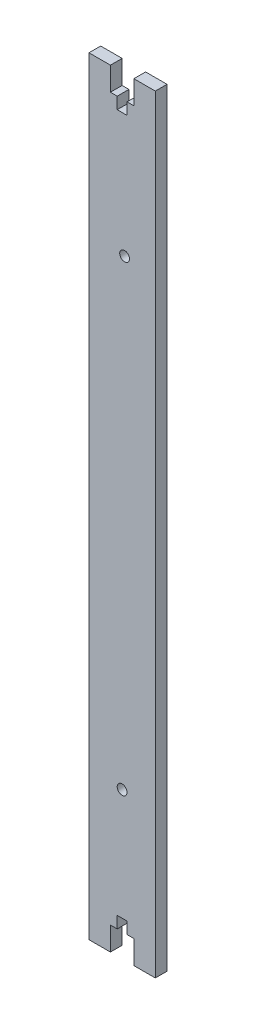
ISO-10303-21;
HEADER;
FILE_DESCRIPTION(('STEP AP214'),'2;1');
FILE_NAME('part.step','',(''),(''),'','','');
FILE_SCHEMA(('AUTOMOTIVE_DESIGN { 1 0 10303 214 1 1 1 1 }'));
ENDSEC;
DATA;
#1=APPLICATION_CONTEXT('core data for automotive mechanical design processes');
#2=APPLICATION_PROTOCOL_DEFINITION('international standard','automotive_design',2000,#1);
#3=PRODUCT_CONTEXT('',#1,'mechanical');
#4=PRODUCT('Part','Part','',(#3));
#5=PRODUCT_RELATED_PRODUCT_CATEGORY('part','',(#4));
#6=PRODUCT_DEFINITION_FORMATION('','',#4);
#7=PRODUCT_DEFINITION_CONTEXT('part definition',#1,'design');
#8=PRODUCT_DEFINITION('design','',#6,#7);
#9=PRODUCT_DEFINITION_SHAPE('','',#8);
#10=(LENGTH_UNIT() NAMED_UNIT(*) SI_UNIT(.MILLI.,.METRE.));
#11=(NAMED_UNIT(*) PLANE_ANGLE_UNIT() SI_UNIT($,.RADIAN.));
#12=(NAMED_UNIT(*) SI_UNIT($,.STERADIAN.) SOLID_ANGLE_UNIT());
#13=UNCERTAINTY_MEASURE_WITH_UNIT(LENGTH_MEASURE(1.E-05),#10,'distance_accuracy_value','');
#14=(GEOMETRIC_REPRESENTATION_CONTEXT(3) GLOBAL_UNCERTAINTY_ASSIGNED_CONTEXT((#13)) GLOBAL_UNIT_ASSIGNED_CONTEXT((#10,
#11,#12)) REPRESENTATION_CONTEXT('',''));
#15=CARTESIAN_POINT('',(0.,0.,0.));
#16=DIRECTION('',(0.,0.,1.));
#17=DIRECTION('',(1.,0.,0.));
#18=AXIS2_PLACEMENT_3D('',#15,#16,#17);
#19=CARTESIAN_POINT('',(-14.14,163.75,5.));
#20=DIRECTION('',(0.,-1.,0.));
#21=DIRECTION('',(0.,0.,-1.));
#22=AXIS2_PLACEMENT_3D('',#19,#20,#21);
#23=PLANE('',#22);
#24=DIRECTION('',(-1.,0.,0.));
#25=VECTOR('',#24,1.);
#26=CARTESIAN_POINT('',(-14.14,163.75,0.));
#27=LINE('',#26,#25);
#28=CARTESIAN_POINT('',(14.14,163.75,0.));
#29=VERTEX_POINT('',#28);
#30=CARTESIAN_POINT('',(5.,163.75,0.));
#31=VERTEX_POINT('',#30);
#32=EDGE_CURVE('E217',#29,#31,#27,.T.);
#33=ORIENTED_EDGE('',*,*,#32,.T.);
#34=DIRECTION('',(0.,0.,1.));
#35=VECTOR('',#34,1.);
#36=CARTESIAN_POINT('',(5.,163.75,-5.));
#37=LINE('',#36,#35);
#38=CARTESIAN_POINT('',(5.,163.75,5.));
#39=VERTEX_POINT('',#38);
#40=EDGE_CURVE('E237',#31,#39,#37,.T.);
#41=ORIENTED_EDGE('',*,*,#40,.T.);
#42=DIRECTION('',(-1.,0.,0.));
#43=VECTOR('',#42,1.);
#44=CARTESIAN_POINT('',(-14.14,163.75,5.));
#45=LINE('',#44,#43);
#46=CARTESIAN_POINT('',(14.14,163.75,5.));
#47=VERTEX_POINT('',#46);
#48=EDGE_CURVE('E196',#47,#39,#45,.T.);
#49=ORIENTED_EDGE('',*,*,#48,.F.);
#50=DIRECTION('',(0.,0.,-1.));
#51=VECTOR('',#50,1.);
#52=CARTESIAN_POINT('',(14.14,163.75,5.));
#53=LINE('',#52,#51);
#54=EDGE_CURVE('E231',#47,#29,#53,.T.);
#55=ORIENTED_EDGE('',*,*,#54,.T.);
#56=EDGE_LOOP('',(#33,#41,#49,#55));
#57=FACE_BOUND('',#56,.T.);
#58=ADVANCED_FACE('F33',(#57),#23,.F.);
#59=CARTESIAN_POINT('',(-14.14,-163.75,5.));
#60=DIRECTION('',(0.,1.,0.));
#61=DIRECTION('',(0.,0.,1.));
#62=AXIS2_PLACEMENT_3D('',#59,#60,#61);
#63=PLANE('',#62);
#64=DIRECTION('',(1.,0.,0.));
#65=VECTOR('',#64,1.);
#66=CARTESIAN_POINT('',(-14.14,-163.75,5.));
#67=LINE('',#66,#65);
#68=CARTESIAN_POINT('',(5.,-163.75,5.));
#69=VERTEX_POINT('',#68);
#70=CARTESIAN_POINT('',(14.14,-163.75,5.));
#71=VERTEX_POINT('',#70);
#72=EDGE_CURVE('E207',#69,#71,#67,.T.);
#73=ORIENTED_EDGE('',*,*,#72,.F.);
#74=DIRECTION('',(0.,0.,1.));
#75=VECTOR('',#74,1.);
#76=CARTESIAN_POINT('',(5.,-163.75,-5.));
#77=LINE('',#76,#75);
#78=CARTESIAN_POINT('',(5.,-163.75,0.));
#79=VERTEX_POINT('',#78);
#80=EDGE_CURVE('E324',#79,#69,#77,.T.);
#81=ORIENTED_EDGE('',*,*,#80,.F.);
#82=DIRECTION('',(1.,0.,0.));
#83=VECTOR('',#82,1.);
#84=CARTESIAN_POINT('',(-14.14,-163.75,0.));
#85=LINE('',#84,#83);
#86=CARTESIAN_POINT('',(14.14,-163.75,0.));
#87=VERTEX_POINT('',#86);
#88=EDGE_CURVE('E222',#79,#87,#85,.T.);
#89=ORIENTED_EDGE('',*,*,#88,.T.);
#90=DIRECTION('',(0.,0.,-1.));
#91=VECTOR('',#90,1.);
#92=CARTESIAN_POINT('',(14.14,-163.75,5.));
#93=LINE('',#92,#91);
#94=EDGE_CURVE('E211',#71,#87,#93,.T.);
#95=ORIENTED_EDGE('',*,*,#94,.F.);
#96=EDGE_LOOP('',(#73,#81,#89,#95));
#97=FACE_BOUND('',#96,.T.);
#98=ADVANCED_FACE('F369',(#97),#63,.F.);
#99=CARTESIAN_POINT('',(14.14,163.75,5.));
#100=DIRECTION('',(-1.,0.,0.));
#101=DIRECTION('',(0.,-1.,0.));
#102=AXIS2_PLACEMENT_3D('',#99,#100,#101);
#103=PLANE('',#102);
#104=DIRECTION('',(0.,1.,0.));
#105=VECTOR('',#104,1.);
#106=CARTESIAN_POINT('',(14.14,163.75,0.));
#107=LINE('',#106,#105);
#108=EDGE_CURVE('E212',#87,#29,#107,.T.);
#109=ORIENTED_EDGE('',*,*,#108,.T.);
#110=ORIENTED_EDGE('',*,*,#54,.F.);
#111=DIRECTION('',(0.,1.,0.));
#112=VECTOR('',#111,1.);
#113=CARTESIAN_POINT('',(14.14,163.75,5.));
#114=LINE('',#113,#112);
#115=EDGE_CURVE('E197',#71,#47,#114,.T.);
#116=ORIENTED_EDGE('',*,*,#115,.F.);
#117=ORIENTED_EDGE('',*,*,#94,.T.);
#118=EDGE_LOOP('',(#109,#110,#116,#117));
#119=FACE_BOUND('',#118,.T.);
#120=ADVANCED_FACE('F35',(#119),#103,.F.);
#121=CARTESIAN_POINT('',(-5.00000000000003,163.75,5.));
#122=VERTEX_POINT('',#121);
#123=CARTESIAN_POINT('',(-14.14,163.75,5.));
#124=VERTEX_POINT('',#123);
#125=EDGE_CURVE('E185',#122,#124,#45,.T.);
#126=ORIENTED_EDGE('',*,*,#125,.F.);
#127=DIRECTION('',(0.,0.,1.));
#128=VECTOR('',#127,1.);
#129=CARTESIAN_POINT('',(-5.00000000000003,163.75,-5.));
#130=LINE('',#129,#128);
#131=CARTESIAN_POINT('',(-5.00000000000003,163.75,0.));
#132=VERTEX_POINT('',#131);
#133=EDGE_CURVE('E169',#132,#122,#130,.T.);
#134=ORIENTED_EDGE('',*,*,#133,.F.);
#135=CARTESIAN_POINT('',(-14.14,163.75,0.));
#136=VERTEX_POINT('',#135);
#137=EDGE_CURVE('E215',#132,#136,#27,.T.);
#138=ORIENTED_EDGE('',*,*,#137,.T.);
#139=DIRECTION('',(0.,0.,-1.));
#140=VECTOR('',#139,1.);
#141=CARTESIAN_POINT('',(-14.14,163.75,5.));
#142=LINE('',#141,#140);
#143=EDGE_CURVE('E194',#124,#136,#142,.T.);
#144=ORIENTED_EDGE('',*,*,#143,.F.);
#145=EDGE_LOOP('',(#126,#134,#138,#144));
#146=FACE_BOUND('',#145,.T.);
#147=ADVANCED_FACE('F192',(#146),#23,.F.);
#148=CARTESIAN_POINT('',(-14.14,163.75,5.));
#149=DIRECTION('',(1.,0.,0.));
#150=DIRECTION('',(0.,1.,0.));
#151=AXIS2_PLACEMENT_3D('',#148,#149,#150);
#152=PLANE('',#151);
#153=DIRECTION('',(0.,-1.,0.));
#154=VECTOR('',#153,1.);
#155=CARTESIAN_POINT('',(-14.14,163.75,0.));
#156=LINE('',#155,#154);
#157=CARTESIAN_POINT('',(-14.14,-163.75,0.));
#158=VERTEX_POINT('',#157);
#159=EDGE_CURVE('E220',#136,#158,#156,.T.);
#160=ORIENTED_EDGE('',*,*,#159,.T.);
#161=DIRECTION('',(0.,0.,-1.));
#162=VECTOR('',#161,1.);
#163=CARTESIAN_POINT('',(-14.14,-163.75,5.));
#164=LINE('',#163,#162);
#165=CARTESIAN_POINT('',(-14.14,-163.75,5.));
#166=VERTEX_POINT('',#165);
#167=EDGE_CURVE('E227',#166,#158,#164,.T.);
#168=ORIENTED_EDGE('',*,*,#167,.F.);
#169=DIRECTION('',(0.,-1.,0.));
#170=VECTOR('',#169,1.);
#171=CARTESIAN_POINT('',(-14.14,163.75,5.));
#172=LINE('',#171,#170);
#173=EDGE_CURVE('E200',#124,#166,#172,.T.);
#174=ORIENTED_EDGE('',*,*,#173,.F.);
#175=ORIENTED_EDGE('',*,*,#143,.T.);
#176=EDGE_LOOP('',(#160,#168,#174,#175));
#177=FACE_BOUND('',#176,.T.);
#178=ADVANCED_FACE('F400',(#177),#152,.F.);
#179=CARTESIAN_POINT('',(-5.00000000000003,-163.75,0.));
#180=VERTEX_POINT('',#179);
#181=EDGE_CURVE('E202',#158,#180,#85,.T.);
#182=ORIENTED_EDGE('',*,*,#181,.T.);
#183=DIRECTION('',(0.,0.,1.));
#184=VECTOR('',#183,1.);
#185=CARTESIAN_POINT('',(-5.00000000000003,-163.75,-5.));
#186=LINE('',#185,#184);
#187=CARTESIAN_POINT('',(-5.00000000000003,-163.75,5.));
#188=VERTEX_POINT('',#187);
#189=EDGE_CURVE('E326',#180,#188,#186,.T.);
#190=ORIENTED_EDGE('',*,*,#189,.T.);
#191=EDGE_CURVE('E208',#166,#188,#67,.T.);
#192=ORIENTED_EDGE('',*,*,#191,.F.);
#193=ORIENTED_EDGE('',*,*,#167,.T.);
#194=EDGE_LOOP('',(#182,#190,#192,#193));
#195=FACE_BOUND('',#194,.T.);
#196=ADVANCED_FACE('F397',(#195),#63,.F.);
#197=CARTESIAN_POINT('',(0.,0.,5.));
#198=DIRECTION('',(0.,0.,1.));
#199=DIRECTION('',(1.,0.,0.));
#200=AXIS2_PLACEMENT_3D('',#197,#198,#199);
#201=PLANE('',#200);
#202=CARTESIAN_POINT('',(-0.00213562373089018,-101.25,5.));
#203=DIRECTION('',(0.,0.,1.));
#204=DIRECTION('',(1.,0.,0.));
#205=AXIS2_PLACEMENT_3D('',#202,#203,#204);
#206=CIRCLE('',#205,2.1);
#207=CARTESIAN_POINT('',(2.09786437626911,-101.25,5.));
#208=VERTEX_POINT('',#207);
#209=EDGE_CURVE('E338',#208,#208,#206,.T.);
#210=ORIENTED_EDGE('',*,*,#209,.F.);
#211=EDGE_LOOP('',(#210));
#212=FACE_BOUND('',#211,.T.);
#213=DIRECTION('',(0.,1.,0.));
#214=VECTOR('',#213,1.);
#215=CARTESIAN_POINT('',(5.,163.75,5.));
#216=LINE('',#215,#214);
#217=CARTESIAN_POINT('',(5.,153.75,5.));
#218=VERTEX_POINT('',#217);
#219=EDGE_CURVE('E179',#218,#39,#216,.T.);
#220=ORIENTED_EDGE('',*,*,#219,.F.);
#221=DIRECTION('',(1.,0.,0.));
#222=VECTOR('',#221,1.);
#223=CARTESIAN_POINT('',(5.,153.75,5.));
#224=LINE('',#223,#222);
#225=CARTESIAN_POINT('',(2.1,153.75,5.));
#226=VERTEX_POINT('',#225);
#227=EDGE_CURVE('E354',#226,#218,#224,.T.);
#228=ORIENTED_EDGE('',*,*,#227,.F.);
#229=DIRECTION('',(0.,1.,0.));
#230=VECTOR('',#229,1.);
#231=CARTESIAN_POINT('',(2.1,153.75,5.));
#232=LINE('',#231,#230);
#233=CARTESIAN_POINT('',(2.1,148.75,5.));
#234=VERTEX_POINT('',#233);
#235=EDGE_CURVE('E287',#234,#226,#232,.T.);
#236=ORIENTED_EDGE('',*,*,#235,.F.);
#237=DIRECTION('',(1.,0.,0.));
#238=VECTOR('',#237,1.);
#239=CARTESIAN_POINT('',(2.1,148.75,5.));
#240=LINE('',#239,#238);
#241=CARTESIAN_POINT('',(-2.10000000000001,148.75,5.));
#242=VERTEX_POINT('',#241);
#243=EDGE_CURVE('E350',#242,#234,#240,.T.);
#244=ORIENTED_EDGE('',*,*,#243,.F.);
#245=DIRECTION('',(0.,-1.,0.));
#246=VECTOR('',#245,1.);
#247=CARTESIAN_POINT('',(-2.10000000000001,153.75,5.));
#248=LINE('',#247,#246);
#249=CARTESIAN_POINT('',(-2.10000000000001,153.75,5.));
#250=VERTEX_POINT('',#249);
#251=EDGE_CURVE('E347',#250,#242,#248,.T.);
#252=ORIENTED_EDGE('',*,*,#251,.F.);
#253=DIRECTION('',(1.,0.,0.));
#254=VECTOR('',#253,1.);
#255=CARTESIAN_POINT('',(-5.00000000000002,153.75,5.));
#256=LINE('',#255,#254);
#257=CARTESIAN_POINT('',(-5.00000000000002,153.75,5.));
#258=VERTEX_POINT('',#257);
#259=EDGE_CURVE('E189',#258,#250,#256,.T.);
#260=ORIENTED_EDGE('',*,*,#259,.F.);
#261=DIRECTION('',(0.,-1.,0.));
#262=VECTOR('',#261,1.);
#263=CARTESIAN_POINT('',(-5.00000000000003,163.75,5.));
#264=LINE('',#263,#262);
#265=EDGE_CURVE('E172',#122,#258,#264,.T.);
#266=ORIENTED_EDGE('',*,*,#265,.F.);
#267=ORIENTED_EDGE('',*,*,#125,.T.);
#268=ORIENTED_EDGE('',*,*,#173,.T.);
#269=ORIENTED_EDGE('',*,*,#191,.T.);
#270=DIRECTION('',(0.,-1.,0.));
#271=VECTOR('',#270,1.);
#272=CARTESIAN_POINT('',(-5.00000000000003,-163.75,5.));
#273=LINE('',#272,#271);
#274=CARTESIAN_POINT('',(-5.00000000000002,-153.75,5.));
#275=VERTEX_POINT('',#274);
#276=EDGE_CURVE('E312',#275,#188,#273,.T.);
#277=ORIENTED_EDGE('',*,*,#276,.F.);
#278=DIRECTION('',(-1.,0.,0.));
#279=VECTOR('',#278,1.);
#280=CARTESIAN_POINT('',(-5.00000000000002,-153.75,5.));
#281=LINE('',#280,#279);
#282=CARTESIAN_POINT('',(-2.10000000000001,-153.75,5.));
#283=VERTEX_POINT('',#282);
#284=EDGE_CURVE('E309',#283,#275,#281,.T.);
#285=ORIENTED_EDGE('',*,*,#284,.F.);
#286=DIRECTION('',(0.,-1.,0.));
#287=VECTOR('',#286,1.);
#288=CARTESIAN_POINT('',(-2.10000000000001,-153.75,5.));
#289=LINE('',#288,#287);
#290=CARTESIAN_POINT('',(-2.10000000000001,-148.75,5.));
#291=VERTEX_POINT('',#290);
#292=EDGE_CURVE('E306',#291,#283,#289,.T.);
#293=ORIENTED_EDGE('',*,*,#292,.F.);
#294=DIRECTION('',(-1.,0.,0.));
#295=VECTOR('',#294,1.);
#296=CARTESIAN_POINT('',(2.1,-148.75,5.));
#297=LINE('',#296,#295);
#298=CARTESIAN_POINT('',(2.1,-148.75,5.));
#299=VERTEX_POINT('',#298);
#300=EDGE_CURVE('E303',#299,#291,#297,.T.);
#301=ORIENTED_EDGE('',*,*,#300,.F.);
#302=DIRECTION('',(0.,1.,0.));
#303=VECTOR('',#302,1.);
#304=CARTESIAN_POINT('',(2.1,-153.75,5.));
#305=LINE('',#304,#303);
#306=CARTESIAN_POINT('',(2.1,-153.75,5.));
#307=VERTEX_POINT('',#306);
#308=EDGE_CURVE('E300',#307,#299,#305,.T.);
#309=ORIENTED_EDGE('',*,*,#308,.F.);
#310=DIRECTION('',(-1.,0.,0.));
#311=VECTOR('',#310,1.);
#312=CARTESIAN_POINT('',(5.,-153.75,5.));
#313=LINE('',#312,#311);
#314=CARTESIAN_POINT('',(5.,-153.75,5.));
#315=VERTEX_POINT('',#314);
#316=EDGE_CURVE('E317',#315,#307,#313,.T.);
#317=ORIENTED_EDGE('',*,*,#316,.F.);
#318=DIRECTION('',(0.,1.,0.));
#319=VECTOR('',#318,1.);
#320=CARTESIAN_POINT('',(5.,-163.75,5.));
#321=LINE('',#320,#319);
#322=EDGE_CURVE('E314',#69,#315,#321,.T.);
#323=ORIENTED_EDGE('',*,*,#322,.F.);
#324=ORIENTED_EDGE('',*,*,#72,.T.);
#325=ORIENTED_EDGE('',*,*,#115,.T.);
#326=ORIENTED_EDGE('',*,*,#48,.T.);
#327=EDGE_LOOP('',(#220,#228,#236,#244,#252,#260,#266,#267,#268,#269,#277,#285,#293,#301,#309,
#317,#323,#324,#325,#326));
#328=FACE_BOUND('',#327,.T.);
#329=CARTESIAN_POINT('',(1.0585245480489,96.25,5.));
#330=DIRECTION('',(0.,0.,1.));
#331=DIRECTION('',(1.,0.,0.));
#332=AXIS2_PLACEMENT_3D('',#329,#330,#331);
#333=CIRCLE('',#332,2.1);
#334=CARTESIAN_POINT('',(3.1585245480489,96.25,5.));
#335=VERTEX_POINT('',#334);
#336=EDGE_CURVE('E304',#335,#335,#333,.T.);
#337=ORIENTED_EDGE('',*,*,#336,.F.);
#338=EDGE_LOOP('',(#337));
#339=FACE_BOUND('',#338,.T.);
#340=ADVANCED_FACE('F183',(#212,#328,#339),#201,.T.);
#341=CARTESIAN_POINT('',(0.,0.,0.));
#342=DIRECTION('',(0.,0.,1.));
#343=DIRECTION('',(1.,0.,0.));
#344=AXIS2_PLACEMENT_3D('',#341,#342,#343);
#345=PLANE('',#344);
#346=CARTESIAN_POINT('',(-0.00213562373089018,-101.25,0.));
#347=DIRECTION('',(0.,0.,1.));
#348=DIRECTION('',(1.,0.,0.));
#349=AXIS2_PLACEMENT_3D('',#346,#347,#348);
#350=CIRCLE('',#349,2.1);
#351=CARTESIAN_POINT('',(2.09786437626911,-101.25,0.));
#352=VERTEX_POINT('',#351);
#353=EDGE_CURVE('E37',#352,#352,#350,.T.);
#354=ORIENTED_EDGE('',*,*,#353,.T.);
#355=EDGE_LOOP('',(#354));
#356=FACE_BOUND('',#355,.T.);
#357=DIRECTION('',(1.,0.,0.));
#358=VECTOR('',#357,1.);
#359=CARTESIAN_POINT('',(0.,153.75,0.));
#360=LINE('',#359,#358);
#361=CARTESIAN_POINT('',(2.1,153.75,0.));
#362=VERTEX_POINT('',#361);
#363=CARTESIAN_POINT('',(5.,153.75,0.));
#364=VERTEX_POINT('',#363);
#365=EDGE_CURVE('E42',#362,#364,#360,.T.);
#366=ORIENTED_EDGE('',*,*,#365,.T.);
#367=DIRECTION('',(0.,1.,0.));
#368=VECTOR('',#367,1.);
#369=CARTESIAN_POINT('',(5.00000000000003,0.,0.));
#370=LINE('',#369,#368);
#371=EDGE_CURVE('E11',#364,#31,#370,.T.);
#372=ORIENTED_EDGE('',*,*,#371,.T.);
#373=ORIENTED_EDGE('',*,*,#32,.F.);
#374=ORIENTED_EDGE('',*,*,#108,.F.);
#375=ORIENTED_EDGE('',*,*,#88,.F.);
#376=DIRECTION('',(0.,1.,0.));
#377=VECTOR('',#376,1.);
#378=CARTESIAN_POINT('',(5.00000000000003,0.,0.));
#379=LINE('',#378,#377);
#380=CARTESIAN_POINT('',(5.,-153.75,0.));
#381=VERTEX_POINT('',#380);
#382=EDGE_CURVE('E255',#79,#381,#379,.T.);
#383=ORIENTED_EDGE('',*,*,#382,.T.);
#384=DIRECTION('',(-1.,0.,0.));
#385=VECTOR('',#384,1.);
#386=CARTESIAN_POINT('',(0.,-153.75,0.));
#387=LINE('',#386,#385);
#388=CARTESIAN_POINT('',(2.1,-153.75,0.));
#389=VERTEX_POINT('',#388);
#390=EDGE_CURVE('E252',#381,#389,#387,.T.);
#391=ORIENTED_EDGE('',*,*,#390,.T.);
#392=DIRECTION('',(0.,1.,0.));
#393=VECTOR('',#392,1.);
#394=CARTESIAN_POINT('',(2.1,0.,0.));
#395=LINE('',#394,#393);
#396=CARTESIAN_POINT('',(2.1,-148.75,0.));
#397=VERTEX_POINT('',#396);
#398=EDGE_CURVE('E249',#389,#397,#395,.T.);
#399=ORIENTED_EDGE('',*,*,#398,.T.);
#400=DIRECTION('',(-1.,0.,0.));
#401=VECTOR('',#400,1.);
#402=CARTESIAN_POINT('',(0.,-148.75,0.));
#403=LINE('',#402,#401);
#404=CARTESIAN_POINT('',(-2.10000000000001,-148.75,0.));
#405=VERTEX_POINT('',#404);
#406=EDGE_CURVE('E234',#397,#405,#403,.T.);
#407=ORIENTED_EDGE('',*,*,#406,.T.);
#408=DIRECTION('',(0.,-1.,0.));
#409=VECTOR('',#408,1.);
#410=CARTESIAN_POINT('',(-2.09999999999975,0.,0.));
#411=LINE('',#410,#409);
#412=CARTESIAN_POINT('',(-2.10000000000001,-153.75,0.));
#413=VERTEX_POINT('',#412);
#414=EDGE_CURVE('E240',#405,#413,#411,.T.);
#415=ORIENTED_EDGE('',*,*,#414,.T.);
#416=DIRECTION('',(-1.,0.,0.));
#417=VECTOR('',#416,1.);
#418=CARTESIAN_POINT('',(0.,-153.75,0.));
#419=LINE('',#418,#417);
#420=CARTESIAN_POINT('',(-5.00000000000002,-153.75,0.));
#421=VERTEX_POINT('',#420);
#422=EDGE_CURVE('E243',#413,#421,#419,.T.);
#423=ORIENTED_EDGE('',*,*,#422,.T.);
#424=DIRECTION('',(0.,-1.,0.));
#425=VECTOR('',#424,1.);
#426=CARTESIAN_POINT('',(-4.99999999999977,0.,0.));
#427=LINE('',#426,#425);
#428=EDGE_CURVE('E246',#421,#180,#427,.T.);
#429=ORIENTED_EDGE('',*,*,#428,.T.);
#430=ORIENTED_EDGE('',*,*,#181,.F.);
#431=ORIENTED_EDGE('',*,*,#159,.F.);
#432=ORIENTED_EDGE('',*,*,#137,.F.);
#433=DIRECTION('',(0.,-1.,0.));
#434=VECTOR('',#433,1.);
#435=CARTESIAN_POINT('',(-4.99999999999977,0.,0.));
#436=LINE('',#435,#434);
#437=CARTESIAN_POINT('',(-5.00000000000002,153.75,0.));
#438=VERTEX_POINT('',#437);
#439=EDGE_CURVE('E175',#132,#438,#436,.T.);
#440=ORIENTED_EDGE('',*,*,#439,.T.);
#441=DIRECTION('',(1.,0.,0.));
#442=VECTOR('',#441,1.);
#443=CARTESIAN_POINT('',(0.,153.75,0.));
#444=LINE('',#443,#442);
#445=CARTESIAN_POINT('',(-2.10000000000001,153.75,0.));
#446=VERTEX_POINT('',#445);
#447=EDGE_CURVE('E259',#438,#446,#444,.T.);
#448=ORIENTED_EDGE('',*,*,#447,.T.);
#449=DIRECTION('',(0.,-1.,0.));
#450=VECTOR('',#449,1.);
#451=CARTESIAN_POINT('',(-2.09999999999975,0.,0.));
#452=LINE('',#451,#450);
#453=CARTESIAN_POINT('',(-2.10000000000001,148.75,0.));
#454=VERTEX_POINT('',#453);
#455=EDGE_CURVE('E262',#446,#454,#452,.T.);
#456=ORIENTED_EDGE('',*,*,#455,.T.);
#457=DIRECTION('',(1.,0.,0.));
#458=VECTOR('',#457,1.);
#459=CARTESIAN_POINT('',(0.,148.75,0.));
#460=LINE('',#459,#458);
#461=CARTESIAN_POINT('',(2.1,148.75,0.));
#462=VERTEX_POINT('',#461);
#463=EDGE_CURVE('E265',#454,#462,#460,.T.);
#464=ORIENTED_EDGE('',*,*,#463,.T.);
#465=DIRECTION('',(0.,1.,0.));
#466=VECTOR('',#465,1.);
#467=CARTESIAN_POINT('',(2.1,0.,0.));
#468=LINE('',#467,#466);
#469=EDGE_CURVE('E268',#462,#362,#468,.T.);
#470=ORIENTED_EDGE('',*,*,#469,.T.);
#471=EDGE_LOOP('',(#366,#372,#373,#374,#375,#383,#391,#399,#407,#415,#423,#429,#430,#431,#432,
#440,#448,#456,#464,#470));
#472=FACE_BOUND('',#471,.T.);
#473=CARTESIAN_POINT('',(1.0585245480489,96.25,0.));
#474=DIRECTION('',(0.,0.,1.));
#475=DIRECTION('',(1.,0.,0.));
#476=AXIS2_PLACEMENT_3D('',#473,#474,#475);
#477=CIRCLE('',#476,2.1);
#478=CARTESIAN_POINT('',(3.1585245480489,96.25,0.));
#479=VERTEX_POINT('',#478);
#480=EDGE_CURVE('E216',#479,#479,#477,.T.);
#481=ORIENTED_EDGE('',*,*,#480,.T.);
#482=EDGE_LOOP('',(#481));
#483=FACE_BOUND('',#482,.T.);
#484=ADVANCED_FACE('F273',(#356,#472,#483),#345,.F.);
#485=CARTESIAN_POINT('',(1.0585245480489,96.25,-5.));
#486=DIRECTION('',(0.,0.,1.));
#487=DIRECTION('',(1.,0.,0.));
#488=AXIS2_PLACEMENT_3D('',#485,#486,#487);
#489=CYLINDRICAL_SURFACE('',#488,2.1);
#490=ORIENTED_EDGE('',*,*,#336,.T.);
#491=EDGE_LOOP('',(#490));
#492=FACE_BOUND('',#491,.T.);
#493=ORIENTED_EDGE('',*,*,#480,.F.);
#494=EDGE_LOOP('',(#493));
#495=FACE_BOUND('',#494,.T.);
#496=ADVANCED_FACE('F459',(#492,#495),#489,.F.);
#497=CARTESIAN_POINT('',(2.1,-153.75,-5.));
#498=DIRECTION('',(1.,0.,0.));
#499=DIRECTION('',(0.,0.,-1.));
#500=AXIS2_PLACEMENT_3D('',#497,#498,#499);
#501=PLANE('',#500);
#502=DIRECTION('',(0.,0.,1.));
#503=VECTOR('',#502,1.);
#504=CARTESIAN_POINT('',(2.1,-153.75,-5.));
#505=LINE('',#504,#503);
#506=EDGE_CURVE('E190',#389,#307,#505,.T.);
#507=ORIENTED_EDGE('',*,*,#506,.T.);
#508=ORIENTED_EDGE('',*,*,#308,.T.);
#509=DIRECTION('',(0.,0.,1.));
#510=VECTOR('',#509,1.);
#511=CARTESIAN_POINT('',(2.1,-148.75,-5.));
#512=LINE('',#511,#510);
#513=EDGE_CURVE('E320',#397,#299,#512,.T.);
#514=ORIENTED_EDGE('',*,*,#513,.F.);
#515=ORIENTED_EDGE('',*,*,#398,.F.);
#516=EDGE_LOOP('',(#507,#508,#514,#515));
#517=FACE_BOUND('',#516,.T.);
#518=ADVANCED_FACE('F381',(#517),#501,.F.);
#519=CARTESIAN_POINT('',(5.,-153.75,-5.));
#520=DIRECTION('',(0.,1.,0.));
#521=DIRECTION('',(0.,0.,1.));
#522=AXIS2_PLACEMENT_3D('',#519,#520,#521);
#523=PLANE('',#522);
#524=DIRECTION('',(0.,0.,1.));
#525=VECTOR('',#524,1.);
#526=CARTESIAN_POINT('',(5.,-153.75,-5.));
#527=LINE('',#526,#525);
#528=EDGE_CURVE('E322',#381,#315,#527,.T.);
#529=ORIENTED_EDGE('',*,*,#528,.T.);
#530=ORIENTED_EDGE('',*,*,#316,.T.);
#531=ORIENTED_EDGE('',*,*,#506,.F.);
#532=ORIENTED_EDGE('',*,*,#390,.F.);
#533=EDGE_LOOP('',(#529,#530,#531,#532));
#534=FACE_BOUND('',#533,.T.);
#535=ADVANCED_FACE('F378',(#534),#523,.F.);
#536=CARTESIAN_POINT('',(5.,-163.75,-5.));
#537=DIRECTION('',(1.,0.,0.));
#538=DIRECTION('',(0.,1.,0.));
#539=AXIS2_PLACEMENT_3D('',#536,#537,#538);
#540=PLANE('',#539);
#541=ORIENTED_EDGE('',*,*,#80,.T.);
#542=ORIENTED_EDGE('',*,*,#322,.T.);
#543=ORIENTED_EDGE('',*,*,#528,.F.);
#544=ORIENTED_EDGE('',*,*,#382,.F.);
#545=EDGE_LOOP('',(#541,#542,#543,#544));
#546=FACE_BOUND('',#545,.T.);
#547=ADVANCED_FACE('F371',(#546),#540,.F.);
#548=CARTESIAN_POINT('',(-5.00000000000003,-163.75,-5.));
#549=DIRECTION('',(-1.,0.,0.));
#550=DIRECTION('',(0.,-1.,0.));
#551=AXIS2_PLACEMENT_3D('',#548,#549,#550);
#552=PLANE('',#551);
#553=DIRECTION('',(0.,0.,1.));
#554=VECTOR('',#553,1.);
#555=CARTESIAN_POINT('',(-5.00000000000002,-153.75,-5.));
#556=LINE('',#555,#554);
#557=EDGE_CURVE('E329',#421,#275,#556,.T.);
#558=ORIENTED_EDGE('',*,*,#557,.T.);
#559=ORIENTED_EDGE('',*,*,#276,.T.);
#560=ORIENTED_EDGE('',*,*,#189,.F.);
#561=ORIENTED_EDGE('',*,*,#428,.F.);
#562=EDGE_LOOP('',(#558,#559,#560,#561));
#563=FACE_BOUND('',#562,.T.);
#564=ADVANCED_FACE('F394',(#563),#552,.F.);
#565=CARTESIAN_POINT('',(-5.00000000000002,-153.75,-5.));
#566=DIRECTION('',(0.,1.,0.));
#567=DIRECTION('',(0.,0.,1.));
#568=AXIS2_PLACEMENT_3D('',#565,#566,#567);
#569=PLANE('',#568);
#570=DIRECTION('',(0.,0.,1.));
#571=VECTOR('',#570,1.);
#572=CARTESIAN_POINT('',(-2.10000000000001,-153.75,-5.));
#573=LINE('',#572,#571);
#574=EDGE_CURVE('E331',#413,#283,#573,.T.);
#575=ORIENTED_EDGE('',*,*,#574,.T.);
#576=ORIENTED_EDGE('',*,*,#284,.T.);
#577=ORIENTED_EDGE('',*,*,#557,.F.);
#578=ORIENTED_EDGE('',*,*,#422,.F.);
#579=EDGE_LOOP('',(#575,#576,#577,#578));
#580=FACE_BOUND('',#579,.T.);
#581=ADVANCED_FACE('F392',(#580),#569,.F.);
#582=CARTESIAN_POINT('',(-2.10000000000001,-153.75,-5.));
#583=DIRECTION('',(-1.,0.,0.));
#584=DIRECTION('',(0.,-1.,0.));
#585=AXIS2_PLACEMENT_3D('',#582,#583,#584);
#586=PLANE('',#585);
#587=DIRECTION('',(0.,0.,1.));
#588=VECTOR('',#587,1.);
#589=CARTESIAN_POINT('',(-2.10000000000001,-148.75,-5.));
#590=LINE('',#589,#588);
#591=EDGE_CURVE('E57',#405,#291,#590,.T.);
#592=ORIENTED_EDGE('',*,*,#591,.T.);
#593=ORIENTED_EDGE('',*,*,#292,.T.);
#594=ORIENTED_EDGE('',*,*,#574,.F.);
#595=ORIENTED_EDGE('',*,*,#414,.F.);
#596=EDGE_LOOP('',(#592,#593,#594,#595));
#597=FACE_BOUND('',#596,.T.);
#598=ADVANCED_FACE('F388',(#597),#586,.F.);
#599=CARTESIAN_POINT('',(2.1,-148.75,-5.));
#600=DIRECTION('',(0.,1.,0.));
#601=DIRECTION('',(0.,0.,1.));
#602=AXIS2_PLACEMENT_3D('',#599,#600,#601);
#603=PLANE('',#602);
#604=ORIENTED_EDGE('',*,*,#513,.T.);
#605=ORIENTED_EDGE('',*,*,#300,.T.);
#606=ORIENTED_EDGE('',*,*,#591,.F.);
#607=ORIENTED_EDGE('',*,*,#406,.F.);
#608=EDGE_LOOP('',(#604,#605,#606,#607));
#609=FACE_BOUND('',#608,.T.);
#610=ADVANCED_FACE('F382',(#609),#603,.F.);
#611=CARTESIAN_POINT('',(5.,163.75,-5.));
#612=DIRECTION('',(1.,0.,0.));
#613=DIRECTION('',(0.,1.,0.));
#614=AXIS2_PLACEMENT_3D('',#611,#612,#613);
#615=PLANE('',#614);
#616=DIRECTION('',(0.,0.,1.));
#617=VECTOR('',#616,1.);
#618=CARTESIAN_POINT('',(5.,153.75,-5.));
#619=LINE('',#618,#617);
#620=EDGE_CURVE('E282',#364,#218,#619,.T.);
#621=ORIENTED_EDGE('',*,*,#620,.T.);
#622=ORIENTED_EDGE('',*,*,#219,.T.);
#623=ORIENTED_EDGE('',*,*,#40,.F.);
#624=ORIENTED_EDGE('',*,*,#371,.F.);
#625=EDGE_LOOP('',(#621,#622,#623,#624));
#626=FACE_BOUND('',#625,.T.);
#627=ADVANCED_FACE('F521',(#626),#615,.F.);
#628=CARTESIAN_POINT('',(5.,153.75,-5.));
#629=DIRECTION('',(0.,-1.,0.));
#630=DIRECTION('',(0.,0.,-1.));
#631=AXIS2_PLACEMENT_3D('',#628,#629,#630);
#632=PLANE('',#631);
#633=DIRECTION('',(0.,0.,1.));
#634=VECTOR('',#633,1.);
#635=CARTESIAN_POINT('',(2.1,153.75,-5.));
#636=LINE('',#635,#634);
#637=EDGE_CURVE('E280',#362,#226,#636,.T.);
#638=ORIENTED_EDGE('',*,*,#637,.T.);
#639=ORIENTED_EDGE('',*,*,#227,.T.);
#640=ORIENTED_EDGE('',*,*,#620,.F.);
#641=ORIENTED_EDGE('',*,*,#365,.F.);
#642=EDGE_LOOP('',(#638,#639,#640,#641));
#643=FACE_BOUND('',#642,.T.);
#644=ADVANCED_FACE('F278',(#643),#632,.F.);
#645=CARTESIAN_POINT('',(2.1,153.75,-5.));
#646=DIRECTION('',(1.,0.,0.));
#647=DIRECTION('',(0.,0.,-1.));
#648=AXIS2_PLACEMENT_3D('',#645,#646,#647);
#649=PLANE('',#648);
#650=DIRECTION('',(0.,0.,1.));
#651=VECTOR('',#650,1.);
#652=CARTESIAN_POINT('',(2.1,148.75,-5.));
#653=LINE('',#652,#651);
#654=EDGE_CURVE('E289',#462,#234,#653,.T.);
#655=ORIENTED_EDGE('',*,*,#654,.T.);
#656=ORIENTED_EDGE('',*,*,#235,.T.);
#657=ORIENTED_EDGE('',*,*,#637,.F.);
#658=ORIENTED_EDGE('',*,*,#469,.F.);
#659=EDGE_LOOP('',(#655,#656,#657,#658));
#660=FACE_BOUND('',#659,.T.);
#661=ADVANCED_FACE('F284',(#660),#649,.F.);
#662=CARTESIAN_POINT('',(2.1,148.75,-5.));
#663=DIRECTION('',(0.,-1.,0.));
#664=DIRECTION('',(0.,0.,-1.));
#665=AXIS2_PLACEMENT_3D('',#662,#663,#664);
#666=PLANE('',#665);
#667=DIRECTION('',(0.,0.,1.));
#668=VECTOR('',#667,1.);
#669=CARTESIAN_POINT('',(-2.10000000000001,148.75,-5.));
#670=LINE('',#669,#668);
#671=EDGE_CURVE('E292',#454,#242,#670,.T.);
#672=ORIENTED_EDGE('',*,*,#671,.T.);
#673=ORIENTED_EDGE('',*,*,#243,.T.);
#674=ORIENTED_EDGE('',*,*,#654,.F.);
#675=ORIENTED_EDGE('',*,*,#463,.F.);
#676=EDGE_LOOP('',(#672,#673,#674,#675));
#677=FACE_BOUND('',#676,.T.);
#678=ADVANCED_FACE('F410',(#677),#666,.F.);
#679=CARTESIAN_POINT('',(-2.10000000000001,153.75,-5.));
#680=DIRECTION('',(-1.,0.,0.));
#681=DIRECTION('',(0.,-1.,0.));
#682=AXIS2_PLACEMENT_3D('',#679,#680,#681);
#683=PLANE('',#682);
#684=DIRECTION('',(0.,0.,1.));
#685=VECTOR('',#684,1.);
#686=CARTESIAN_POINT('',(-2.10000000000001,153.75,-5.));
#687=LINE('',#686,#685);
#688=EDGE_CURVE('E297',#446,#250,#687,.T.);
#689=ORIENTED_EDGE('',*,*,#688,.T.);
#690=ORIENTED_EDGE('',*,*,#251,.T.);
#691=ORIENTED_EDGE('',*,*,#671,.F.);
#692=ORIENTED_EDGE('',*,*,#455,.F.);
#693=EDGE_LOOP('',(#689,#690,#691,#692));
#694=FACE_BOUND('',#693,.T.);
#695=ADVANCED_FACE('F406',(#694),#683,.F.);
#696=CARTESIAN_POINT('',(-5.00000000000002,153.75,-5.));
#697=DIRECTION('',(0.,-1.,0.));
#698=DIRECTION('',(0.,0.,-1.));
#699=AXIS2_PLACEMENT_3D('',#696,#697,#698);
#700=PLANE('',#699);
#701=DIRECTION('',(0.,0.,1.));
#702=VECTOR('',#701,1.);
#703=CARTESIAN_POINT('',(-5.00000000000002,153.75,-5.));
#704=LINE('',#703,#702);
#705=EDGE_CURVE('E49',#438,#258,#704,.T.);
#706=ORIENTED_EDGE('',*,*,#705,.T.);
#707=ORIENTED_EDGE('',*,*,#259,.T.);
#708=ORIENTED_EDGE('',*,*,#688,.F.);
#709=ORIENTED_EDGE('',*,*,#447,.F.);
#710=EDGE_LOOP('',(#706,#707,#708,#709));
#711=FACE_BOUND('',#710,.T.);
#712=ADVANCED_FACE('F404',(#711),#700,.F.);
#713=CARTESIAN_POINT('',(-5.00000000000003,163.75,-5.));
#714=DIRECTION('',(-1.,0.,0.));
#715=DIRECTION('',(0.,-1.,0.));
#716=AXIS2_PLACEMENT_3D('',#713,#714,#715);
#717=PLANE('',#716);
#718=ORIENTED_EDGE('',*,*,#133,.T.);
#719=ORIENTED_EDGE('',*,*,#265,.T.);
#720=ORIENTED_EDGE('',*,*,#705,.F.);
#721=ORIENTED_EDGE('',*,*,#439,.F.);
#722=EDGE_LOOP('',(#718,#719,#720,#721));
#723=FACE_BOUND('',#722,.T.);
#724=ADVANCED_FACE('F171',(#723),#717,.F.);
#725=CARTESIAN_POINT('',(-0.00213562373089018,-101.25,-5.));
#726=DIRECTION('',(0.,0.,1.));
#727=DIRECTION('',(1.,0.,0.));
#728=AXIS2_PLACEMENT_3D('',#725,#726,#727);
#729=CYLINDRICAL_SURFACE('',#728,2.1);
#730=ORIENTED_EDGE('',*,*,#209,.T.);
#731=EDGE_LOOP('',(#730));
#732=FACE_BOUND('',#731,.T.);
#733=ORIENTED_EDGE('',*,*,#353,.F.);
#734=EDGE_LOOP('',(#733));
#735=FACE_BOUND('',#734,.T.);
#736=ADVANCED_FACE('F570',(#732,#735),#729,.F.);
#737=CLOSED_SHELL('',(#58,#98,#120,#147,#178,#196,#340,#484,#496,#518,#535,#547,#564,#581,#598,
#610,#627,#644,#661,#678,#695,#712,#724,#736));
#738=MANIFOLD_SOLID_BREP('B2',#737);
#739=ADVANCED_BREP_SHAPE_REPRESENTATION('',(#18,#738),#14);
#740=SHAPE_DEFINITION_REPRESENTATION(#9,#739);
ENDSEC;
END-ISO-10303-21;
